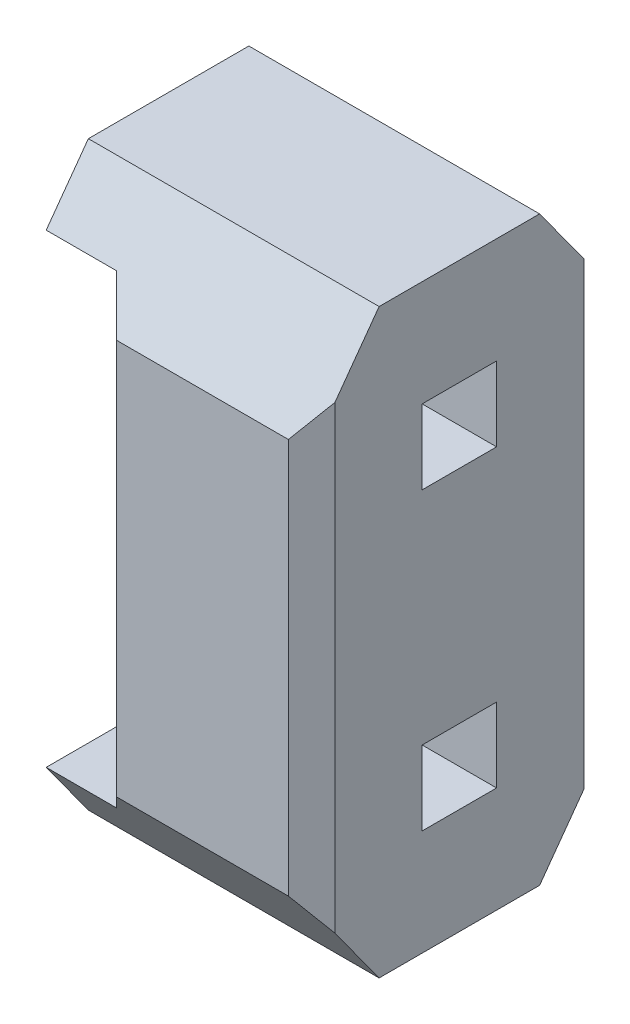
ISO-10303-21;
HEADER;
FILE_DESCRIPTION(('STEP AP214'),'2;1');
FILE_NAME('part.step','',(''),(''),'','','');
FILE_SCHEMA(('AUTOMOTIVE_DESIGN { 1 0 10303 214 1 1 1 1 }'));
ENDSEC;
DATA;
#1=APPLICATION_CONTEXT('core data for automotive mechanical design processes');
#2=APPLICATION_PROTOCOL_DEFINITION('international standard','automotive_design',2000,#1);
#3=PRODUCT_CONTEXT('',#1,'mechanical');
#4=PRODUCT('Part','Part','',(#3));
#5=PRODUCT_RELATED_PRODUCT_CATEGORY('part','',(#4));
#6=PRODUCT_DEFINITION_FORMATION('','',#4);
#7=PRODUCT_DEFINITION_CONTEXT('part definition',#1,'design');
#8=PRODUCT_DEFINITION('design','',#6,#7);
#9=PRODUCT_DEFINITION_SHAPE('','',#8);
#10=(LENGTH_UNIT() NAMED_UNIT(*) SI_UNIT(.MILLI.,.METRE.));
#11=(NAMED_UNIT(*) PLANE_ANGLE_UNIT() SI_UNIT($,.RADIAN.));
#12=(NAMED_UNIT(*) SI_UNIT($,.STERADIAN.) SOLID_ANGLE_UNIT());
#13=UNCERTAINTY_MEASURE_WITH_UNIT(LENGTH_MEASURE(1.E-05),#10,'distance_accuracy_value','');
#14=(GEOMETRIC_REPRESENTATION_CONTEXT(3) GLOBAL_UNCERTAINTY_ASSIGNED_CONTEXT((#13)) GLOBAL_UNIT_ASSIGNED_CONTEXT((#10,
#11,#12)) REPRESENTATION_CONTEXT('',''));
#15=CARTESIAN_POINT('',(0.,0.,0.));
#16=DIRECTION('',(0.,0.,1.));
#17=DIRECTION('',(1.,0.,0.));
#18=AXIS2_PLACEMENT_3D('',#15,#16,#17);
#19=CARTESIAN_POINT('',(1.25,4.6,-20.61));
#20=DIRECTION('',(0.,0.586967571460905,0.809610443394407));
#21=DIRECTION('',(0.,-0.809610443394407,0.586967571460905));
#22=AXIS2_PLACEMENT_3D('',#19,#20,#21);
#23=PLANE('',#22);
#24=DIRECTION('',(1.,0.,0.));
#25=VECTOR('',#24,1.);
#26=CARTESIAN_POINT('',(1.25,4.5,-20.5375));
#27=LINE('',#26,#25);
#28=CARTESIAN_POINT('',(0.,4.5,-20.5375));
#29=VERTEX_POINT('',#28);
#30=CARTESIAN_POINT('',(0.602500000000325,4.5,-20.5375000000001));
#31=VERTEX_POINT('',#30);
#32=EDGE_CURVE('E199',#29,#31,#27,.T.);
#33=ORIENTED_EDGE('',*,*,#32,.T.);
#34=DIRECTION('',(0.506207656348698,-0.698217457033983,0.506207656349602));
#35=VECTOR('',#34,1.);
#36=CARTESIAN_POINT('',(0.6025000000002,4.5,-20.5375));
#37=LINE('',#36,#35);
#38=CARTESIAN_POINT('',(0.819999999999671,4.2,-20.3199999999999));
#39=VERTEX_POINT('',#38);
#40=EDGE_CURVE('E197',#31,#39,#37,.T.);
#41=ORIENTED_EDGE('',*,*,#40,.T.);
#42=DIRECTION('',(1.,0.,0.));
#43=VECTOR('',#42,1.);
#44=CARTESIAN_POINT('',(1.25,4.19999999999999,-20.32));
#45=LINE('',#44,#43);
#46=CARTESIAN_POINT('',(2.30000000000012,4.2,-20.3199999999999));
#47=VERTEX_POINT('',#46);
#48=EDGE_CURVE('E20',#39,#47,#45,.T.);
#49=ORIENTED_EDGE('',*,*,#48,.T.);
#50=DIRECTION('',(0.506207656348961,0.698217457033859,-0.50620765634951));
#51=VECTOR('',#50,1.);
#52=CARTESIAN_POINT('',(2.3,4.19999999999999,-20.32));
#53=LINE('',#52,#51);
#54=CARTESIAN_POINT('',(2.49999999999988,4.47586206896591,-20.5200000000002));
#55=VERTEX_POINT('',#54);
#56=EDGE_CURVE('E181',#47,#55,#53,.T.);
#57=ORIENTED_EDGE('',*,*,#56,.T.);
#58=DIRECTION('',(0.,-0.809610443394407,0.586967571460905));
#59=VECTOR('',#58,1.);
#60=CARTESIAN_POINT('',(2.5,4.6,-20.61));
#61=LINE('',#60,#59);
#62=CARTESIAN_POINT('',(2.5,5.,-20.9));
#63=VERTEX_POINT('',#62);
#64=EDGE_CURVE('E188',#55,#63,#61,.F.);
#65=ORIENTED_EDGE('',*,*,#64,.T.);
#66=DIRECTION('',(1.,0.,0.));
#67=VECTOR('',#66,1.);
#68=CARTESIAN_POINT('',(1.25,5.,-20.9));
#69=LINE('',#68,#67);
#70=CARTESIAN_POINT('',(0.,5.,-20.9));
#71=VERTEX_POINT('',#70);
#72=EDGE_CURVE('E215',#71,#63,#69,.T.);
#73=ORIENTED_EDGE('',*,*,#72,.F.);
#74=DIRECTION('',(0.,-0.809610443394407,0.586967571460905));
#75=VECTOR('',#74,1.);
#76=CARTESIAN_POINT('',(0.,4.6,-20.61));
#77=LINE('',#76,#75);
#78=EDGE_CURVE('E207',#71,#29,#77,.T.);
#79=ORIENTED_EDGE('',*,*,#78,.T.);
#80=EDGE_LOOP('',(#33,#41,#49,#57,#65,#73,#79));
#81=FACE_BOUND('',#80,.T.);
#82=ADVANCED_FACE('F17',(#81),#23,.T.);
#83=CARTESIAN_POINT('',(1.25,4.6,-22.57));
#84=DIRECTION('',(0.,-0.586967571460905,0.809610443394407));
#85=DIRECTION('',(0.,-0.809610443394407,-0.586967571460905));
#86=AXIS2_PLACEMENT_3D('',#83,#84,#85);
#87=PLANE('',#86);
#88=DIRECTION('',(0.,-0.809610443394407,-0.586967571460905));
#89=VECTOR('',#88,1.);
#90=CARTESIAN_POINT('',(0.,4.6,-22.57));
#91=LINE('',#90,#89);
#92=CARTESIAN_POINT('',(0.,5.,-22.28));
#93=VERTEX_POINT('',#92);
#94=CARTESIAN_POINT('',(0.,4.5,-22.6425));
#95=VERTEX_POINT('',#94);
#96=EDGE_CURVE('E263',#93,#95,#91,.T.);
#97=ORIENTED_EDGE('',*,*,#96,.F.);
#98=DIRECTION('',(1.,0.,0.));
#99=VECTOR('',#98,1.);
#100=CARTESIAN_POINT('',(1.25,5.,-22.28));
#101=LINE('',#100,#99);
#102=CARTESIAN_POINT('',(2.5,5.,-22.28));
#103=VERTEX_POINT('',#102);
#104=EDGE_CURVE('E227',#103,#93,#101,.F.);
#105=ORIENTED_EDGE('',*,*,#104,.F.);
#106=DIRECTION('',(0.,-0.809610443394407,-0.586967571460905));
#107=VECTOR('',#106,1.);
#108=CARTESIAN_POINT('',(2.5,4.6,-22.57));
#109=LINE('',#108,#107);
#110=CARTESIAN_POINT('',(2.49999999999988,4.47586206896591,-22.6599999999998));
#111=VERTEX_POINT('',#110);
#112=EDGE_CURVE('E223',#111,#103,#109,.F.);
#113=ORIENTED_EDGE('',*,*,#112,.F.);
#114=DIRECTION('',(0.506207656348961,0.698217457033859,0.50620765634951));
#115=VECTOR('',#114,1.);
#116=CARTESIAN_POINT('',(2.3,4.19999999999999,-22.86));
#117=LINE('',#116,#115);
#118=CARTESIAN_POINT('',(2.30000000000012,4.2,-22.8600000000001));
#119=VERTEX_POINT('',#118);
#120=EDGE_CURVE('E266',#119,#111,#117,.T.);
#121=ORIENTED_EDGE('',*,*,#120,.F.);
#122=DIRECTION('',(1.,0.,0.));
#123=VECTOR('',#122,1.);
#124=CARTESIAN_POINT('',(1.25,4.19999999999999,-22.86));
#125=LINE('',#124,#123);
#126=CARTESIAN_POINT('',(0.819999999999671,4.2,-22.8600000000001));
#127=VERTEX_POINT('',#126);
#128=EDGE_CURVE('E205',#127,#119,#125,.T.);
#129=ORIENTED_EDGE('',*,*,#128,.F.);
#130=DIRECTION('',(0.506207656348698,-0.698217457033983,-0.506207656349602));
#131=VECTOR('',#130,1.);
#132=CARTESIAN_POINT('',(0.6025000000002,4.5,-22.6425));
#133=LINE('',#132,#131);
#134=CARTESIAN_POINT('',(0.602500000000325,4.5,-22.6424999999999));
#135=VERTEX_POINT('',#134);
#136=EDGE_CURVE('E203',#135,#127,#133,.T.);
#137=ORIENTED_EDGE('',*,*,#136,.F.);
#138=DIRECTION('',(1.,0.,0.));
#139=VECTOR('',#138,1.);
#140=CARTESIAN_POINT('',(1.25,4.5,-22.6425));
#141=LINE('',#140,#139);
#142=EDGE_CURVE('E261',#95,#135,#141,.T.);
#143=ORIENTED_EDGE('',*,*,#142,.F.);
#144=EDGE_LOOP('',(#97,#105,#113,#121,#129,#137,#143));
#145=FACE_BOUND('',#144,.T.);
#146=ADVANCED_FACE('F285',(#145),#87,.F.);
#147=CARTESIAN_POINT('',(1.25,0.4,-22.57));
#148=DIRECTION('',(0.,0.586967571460905,0.809610443394407));
#149=DIRECTION('',(0.,-0.809610443394407,0.586967571460905));
#150=AXIS2_PLACEMENT_3D('',#147,#148,#149);
#151=PLANE('',#150);
#152=DIRECTION('',(-0.506207656349401,0.698217457033646,-0.506207656349363));
#153=VECTOR('',#152,1.);
#154=CARTESIAN_POINT('',(2.5,0.524137931034496,-22.66));
#155=LINE('',#154,#153);
#156=CARTESIAN_POINT('',(2.49999999999988,0.524137931034498,-22.6599999999999));
#157=VERTEX_POINT('',#156);
#158=CARTESIAN_POINT('',(2.30000000000012,0.800000000000005,-22.8600000000001));
#159=VERTEX_POINT('',#158);
#160=EDGE_CURVE('E251',#157,#159,#155,.T.);
#161=ORIENTED_EDGE('',*,*,#160,.F.);
#162=DIRECTION('',(0.,-0.809610443394407,0.586967571460905));
#163=VECTOR('',#162,1.);
#164=CARTESIAN_POINT('',(2.5,0.4,-22.57));
#165=LINE('',#164,#163);
#166=CARTESIAN_POINT('',(2.5,0.,-22.28));
#167=VERTEX_POINT('',#166);
#168=EDGE_CURVE('E253',#167,#157,#165,.F.);
#169=ORIENTED_EDGE('',*,*,#168,.F.);
#170=DIRECTION('',(1.,0.,0.));
#171=VECTOR('',#170,1.);
#172=CARTESIAN_POINT('',(1.25,0.,-22.28));
#173=LINE('',#172,#171);
#174=CARTESIAN_POINT('',(0.,0.,-22.28));
#175=VERTEX_POINT('',#174);
#176=EDGE_CURVE('E288',#167,#175,#173,.F.);
#177=ORIENTED_EDGE('',*,*,#176,.T.);
#178=DIRECTION('',(0.,-0.809610443394407,0.586967571460905));
#179=VECTOR('',#178,1.);
#180=CARTESIAN_POINT('',(0.,0.4,-22.57));
#181=LINE('',#180,#179);
#182=CARTESIAN_POINT('',(0.,0.500000000000001,-22.6425));
#183=VERTEX_POINT('',#182);
#184=EDGE_CURVE('E255',#183,#175,#181,.T.);
#185=ORIENTED_EDGE('',*,*,#184,.F.);
#186=DIRECTION('',(1.,0.,0.));
#187=VECTOR('',#186,1.);
#188=CARTESIAN_POINT('',(1.25,0.500000000000002,-22.6425));
#189=LINE('',#188,#187);
#190=CARTESIAN_POINT('',(0.602500000000325,0.500000000000001,-22.6424999999999));
#191=VERTEX_POINT('',#190);
#192=EDGE_CURVE('E257',#191,#183,#189,.F.);
#193=ORIENTED_EDGE('',*,*,#192,.F.);
#194=DIRECTION('',(-0.506207656348694,-0.698217457033983,0.506207656349606));
#195=VECTOR('',#194,1.);
#196=CARTESIAN_POINT('',(0.8199999999998,0.80000000000001,-22.86));
#197=LINE('',#196,#195);
#198=CARTESIAN_POINT('',(0.819999999999671,0.800000000000005,-22.8600000000001));
#199=VERTEX_POINT('',#198);
#200=EDGE_CURVE('E259',#199,#191,#197,.T.);
#201=ORIENTED_EDGE('',*,*,#200,.F.);
#202=DIRECTION('',(1.,0.,0.));
#203=VECTOR('',#202,1.);
#204=CARTESIAN_POINT('',(1.25,0.80000000000001,-22.86));
#205=LINE('',#204,#203);
#206=EDGE_CURVE('E249',#159,#199,#205,.F.);
#207=ORIENTED_EDGE('',*,*,#206,.F.);
#208=EDGE_LOOP('',(#161,#169,#177,#185,#193,#201,#207));
#209=FACE_BOUND('',#208,.T.);
#210=ADVANCED_FACE('F431',(#209),#151,.F.);
#211=CARTESIAN_POINT('',(1.25,0.4,-20.61));
#212=DIRECTION('',(0.,-0.586967571460905,0.809610443394407));
#213=DIRECTION('',(0.,-0.809610443394407,-0.586967571460905));
#214=AXIS2_PLACEMENT_3D('',#211,#212,#213);
#215=PLANE('',#214);
#216=DIRECTION('',(1.,0.,0.));
#217=VECTOR('',#216,1.);
#218=CARTESIAN_POINT('',(1.25,0.80000000000001,-20.32));
#219=LINE('',#218,#217);
#220=CARTESIAN_POINT('',(2.30000000000012,0.800000000000005,-20.3199999999999));
#221=VERTEX_POINT('',#220);
#222=CARTESIAN_POINT('',(0.819999999999671,0.800000000000005,-20.3199999999999));
#223=VERTEX_POINT('',#222);
#224=EDGE_CURVE('E191',#221,#223,#219,.F.);
#225=ORIENTED_EDGE('',*,*,#224,.T.);
#226=DIRECTION('',(-0.506207656348694,-0.698217457033983,-0.506207656349606));
#227=VECTOR('',#226,1.);
#228=CARTESIAN_POINT('',(0.8199999999998,0.80000000000001,-20.32));
#229=LINE('',#228,#227);
#230=CARTESIAN_POINT('',(0.602500000000325,0.500000000000001,-20.5375000000001));
#231=VERTEX_POINT('',#230);
#232=EDGE_CURVE('E232',#223,#231,#229,.T.);
#233=ORIENTED_EDGE('',*,*,#232,.T.);
#234=DIRECTION('',(1.,0.,0.));
#235=VECTOR('',#234,1.);
#236=CARTESIAN_POINT('',(1.25,0.500000000000002,-20.5375));
#237=LINE('',#236,#235);
#238=CARTESIAN_POINT('',(0.,0.500000000000001,-20.5375));
#239=VERTEX_POINT('',#238);
#240=EDGE_CURVE('E246',#231,#239,#237,.F.);
#241=ORIENTED_EDGE('',*,*,#240,.T.);
#242=DIRECTION('',(0.,-0.809610443394407,-0.586967571460905));
#243=VECTOR('',#242,1.);
#244=CARTESIAN_POINT('',(0.,0.4,-20.61));
#245=LINE('',#244,#243);
#246=CARTESIAN_POINT('',(0.,0.,-20.9));
#247=VERTEX_POINT('',#246);
#248=EDGE_CURVE('E244',#239,#247,#245,.T.);
#249=ORIENTED_EDGE('',*,*,#248,.T.);
#250=DIRECTION('',(1.,0.,0.));
#251=VECTOR('',#250,1.);
#252=CARTESIAN_POINT('',(1.25,0.,-20.9));
#253=LINE('',#252,#251);
#254=CARTESIAN_POINT('',(2.5,0.,-20.9));
#255=VERTEX_POINT('',#254);
#256=EDGE_CURVE('E293',#247,#255,#253,.T.);
#257=ORIENTED_EDGE('',*,*,#256,.T.);
#258=DIRECTION('',(0.,-0.809610443394407,-0.586967571460905));
#259=VECTOR('',#258,1.);
#260=CARTESIAN_POINT('',(2.5,0.4,-20.61));
#261=LINE('',#260,#259);
#262=CARTESIAN_POINT('',(2.49999999999988,0.524137931034498,-20.5200000000001));
#263=VERTEX_POINT('',#262);
#264=EDGE_CURVE('E241',#255,#263,#261,.F.);
#265=ORIENTED_EDGE('',*,*,#264,.T.);
#266=DIRECTION('',(-0.506207656349401,0.698217457033646,0.506207656349363));
#267=VECTOR('',#266,1.);
#268=CARTESIAN_POINT('',(2.5,0.524137931034496,-20.52));
#269=LINE('',#268,#267);
#270=EDGE_CURVE('E239',#263,#221,#269,.T.);
#271=ORIENTED_EDGE('',*,*,#270,.T.);
#272=EDGE_LOOP('',(#225,#233,#241,#249,#257,#265,#271));
#273=FACE_BOUND('',#272,.T.);
#274=ADVANCED_FACE('F421',(#273),#215,.T.);
#275=CARTESIAN_POINT('',(1.25,5.,-21.59));
#276=DIRECTION('',(0.,1.,0.));
#277=DIRECTION('',(0.,0.,1.));
#278=AXIS2_PLACEMENT_3D('',#275,#276,#277);
#279=PLANE('',#278);
#280=ORIENTED_EDGE('',*,*,#104,.T.);
#281=DIRECTION('',(0.,0.,-1.));
#282=VECTOR('',#281,1.);
#283=CARTESIAN_POINT('',(0.,5.,-21.59));
#284=LINE('',#283,#282);
#285=EDGE_CURVE('E231',#93,#71,#284,.F.);
#286=ORIENTED_EDGE('',*,*,#285,.T.);
#287=ORIENTED_EDGE('',*,*,#72,.T.);
#288=DIRECTION('',(0.,0.,1.));
#289=VECTOR('',#288,1.);
#290=CARTESIAN_POINT('',(2.5,5.,-21.59));
#291=LINE('',#290,#289);
#292=EDGE_CURVE('E219',#63,#103,#291,.F.);
#293=ORIENTED_EDGE('',*,*,#292,.T.);
#294=EDGE_LOOP('',(#280,#286,#287,#293));
#295=FACE_BOUND('',#294,.T.);
#296=ADVANCED_FACE('F229',(#295),#279,.T.);
#297=CARTESIAN_POINT('',(1.25,0.,-21.59));
#298=DIRECTION('',(0.,1.,0.));
#299=DIRECTION('',(0.,0.,1.));
#300=AXIS2_PLACEMENT_3D('',#297,#298,#299);
#301=PLANE('',#300);
#302=DIRECTION('',(0.,0.,-1.));
#303=VECTOR('',#302,1.);
#304=CARTESIAN_POINT('',(0.,0.,-21.59));
#305=LINE('',#304,#303);
#306=EDGE_CURVE('E297',#247,#175,#305,.T.);
#307=ORIENTED_EDGE('',*,*,#306,.T.);
#308=ORIENTED_EDGE('',*,*,#176,.F.);
#309=DIRECTION('',(0.,0.,1.));
#310=VECTOR('',#309,1.);
#311=CARTESIAN_POINT('',(2.5,0.,-21.59));
#312=LINE('',#311,#310);
#313=EDGE_CURVE('E287',#255,#167,#312,.F.);
#314=ORIENTED_EDGE('',*,*,#313,.F.);
#315=ORIENTED_EDGE('',*,*,#256,.F.);
#316=EDGE_LOOP('',(#307,#308,#314,#315));
#317=FACE_BOUND('',#316,.T.);
#318=ADVANCED_FACE('F428',(#317),#301,.F.);
#319=CARTESIAN_POINT('',(0.,4.75,-21.59));
#320=DIRECTION('',(1.,0.,0.));
#321=DIRECTION('',(0.,0.,-1.));
#322=AXIS2_PLACEMENT_3D('',#319,#320,#321);
#323=PLANE('',#322);
#324=ORIENTED_EDGE('',*,*,#285,.F.);
#325=ORIENTED_EDGE('',*,*,#96,.T.);
#326=DIRECTION('',(0.,0.,1.));
#327=VECTOR('',#326,1.);
#328=CARTESIAN_POINT('',(0.,4.5,-21.59));
#329=LINE('',#328,#327);
#330=EDGE_CURVE('E307',#95,#29,#329,.T.);
#331=ORIENTED_EDGE('',*,*,#330,.T.);
#332=ORIENTED_EDGE('',*,*,#78,.F.);
#333=EDGE_LOOP('',(#324,#325,#331,#332));
#334=FACE_BOUND('',#333,.T.);
#335=ADVANCED_FACE('F441',(#334),#323,.F.);
#336=CARTESIAN_POINT('',(0.,0.25,-21.59));
#337=DIRECTION('',(1.,0.,0.));
#338=DIRECTION('',(0.,0.,-1.));
#339=AXIS2_PLACEMENT_3D('',#336,#337,#338);
#340=PLANE('',#339);
#341=ORIENTED_EDGE('',*,*,#306,.F.);
#342=ORIENTED_EDGE('',*,*,#248,.F.);
#343=DIRECTION('',(0.,0.,1.));
#344=VECTOR('',#343,1.);
#345=CARTESIAN_POINT('',(0.,0.5,-21.59));
#346=LINE('',#345,#344);
#347=EDGE_CURVE('E315',#183,#239,#346,.T.);
#348=ORIENTED_EDGE('',*,*,#347,.F.);
#349=ORIENTED_EDGE('',*,*,#184,.T.);
#350=EDGE_LOOP('',(#341,#342,#348,#349));
#351=FACE_BOUND('',#350,.T.);
#352=ADVANCED_FACE('F443',(#351),#340,.F.);
#353=CARTESIAN_POINT('',(1.55,3.45,-21.59));
#354=DIRECTION('',(0.,1.,0.));
#355=DIRECTION('',(0.,0.,1.));
#356=AXIS2_PLACEMENT_3D('',#353,#354,#355);
#357=PLANE('',#356);
#358=DIRECTION('',(1.,0.,0.));
#359=VECTOR('',#358,1.);
#360=CARTESIAN_POINT('',(1.55,3.45,-21.91));
#361=LINE('',#360,#359);
#362=CARTESIAN_POINT('',(0.6,3.45,-21.91));
#363=VERTEX_POINT('',#362);
#364=CARTESIAN_POINT('',(2.5,3.45,-21.91));
#365=VERTEX_POINT('',#364);
#366=EDGE_CURVE('E332',#363,#365,#361,.T.);
#367=ORIENTED_EDGE('',*,*,#366,.F.);
#368=DIRECTION('',(0.,0.,1.));
#369=VECTOR('',#368,1.);
#370=CARTESIAN_POINT('',(0.6,3.45,-21.59));
#371=LINE('',#370,#369);
#372=CARTESIAN_POINT('',(0.6,3.45,-21.27));
#373=VERTEX_POINT('',#372);
#374=EDGE_CURVE('E302',#363,#373,#371,.T.);
#375=ORIENTED_EDGE('',*,*,#374,.T.);
#376=DIRECTION('',(1.,0.,0.));
#377=VECTOR('',#376,1.);
#378=CARTESIAN_POINT('',(1.55,3.45,-21.27));
#379=LINE('',#378,#377);
#380=CARTESIAN_POINT('',(2.5,3.45,-21.27));
#381=VERTEX_POINT('',#380);
#382=EDGE_CURVE('E327',#373,#381,#379,.T.);
#383=ORIENTED_EDGE('',*,*,#382,.T.);
#384=DIRECTION('',(0.,0.,1.));
#385=VECTOR('',#384,1.);
#386=CARTESIAN_POINT('',(2.5,3.45,-21.59));
#387=LINE('',#386,#385);
#388=EDGE_CURVE('E300',#381,#365,#387,.F.);
#389=ORIENTED_EDGE('',*,*,#388,.T.);
#390=EDGE_LOOP('',(#367,#375,#383,#389));
#391=FACE_BOUND('',#390,.T.);
#392=ADVANCED_FACE('F398',(#391),#357,.T.);
#393=CARTESIAN_POINT('',(0.71,2.5,-22.75));
#394=DIRECTION('',(0.707106781190498,0.,0.707106781182598));
#395=DIRECTION('',(0.707106781182598,0.,-0.707106781190498));
#396=AXIS2_PLACEMENT_3D('',#393,#394,#395);
#397=PLANE('',#396);
#398=ORIENTED_EDGE('',*,*,#200,.T.);
#399=DIRECTION('',(0.70710678118667,0.,-0.707106781186425));
#400=VECTOR('',#399,1.);
#401=CARTESIAN_POINT('',(0.6000000000002,0.5,-22.64));
#402=LINE('',#401,#400);
#403=CARTESIAN_POINT('',(0.600000000000408,0.5,-22.6399999999997));
#404=VERTEX_POINT('',#403);
#405=EDGE_CURVE('E312',#404,#191,#402,.T.);
#406=ORIENTED_EDGE('',*,*,#405,.F.);
#407=DIRECTION('',(0.,1.,0.));
#408=VECTOR('',#407,1.);
#409=CARTESIAN_POINT('',(0.6,2.5,-22.64));
#410=LINE('',#409,#408);
#411=CARTESIAN_POINT('',(0.600000000000408,4.5,-22.6399999999997));
#412=VERTEX_POINT('',#411);
#413=EDGE_CURVE('E337',#404,#412,#410,.T.);
#414=ORIENTED_EDGE('',*,*,#413,.T.);
#415=DIRECTION('',(0.70710678118667,0.,-0.707106781186425));
#416=VECTOR('',#415,1.);
#417=CARTESIAN_POINT('',(0.6000000000002,4.5,-22.64));
#418=LINE('',#417,#416);
#419=EDGE_CURVE('E304',#412,#135,#418,.T.);
#420=ORIENTED_EDGE('',*,*,#419,.T.);
#421=ORIENTED_EDGE('',*,*,#136,.T.);
#422=DIRECTION('',(0.,1.,0.));
#423=VECTOR('',#422,1.);
#424=CARTESIAN_POINT('',(0.8199999999998,2.5,-22.86));
#425=LINE('',#424,#423);
#426=EDGE_CURVE('E275',#127,#199,#425,.F.);
#427=ORIENTED_EDGE('',*,*,#426,.T.);
#428=EDGE_LOOP('',(#398,#406,#414,#420,#421,#427));
#429=FACE_BOUND('',#428,.T.);
#430=ADVANCED_FACE('F435',(#429),#397,.F.);
#431=CARTESIAN_POINT('',(0.30125,4.5,-21.59));
#432=DIRECTION('',(0.,1.,0.));
#433=DIRECTION('',(0.,0.,1.));
#434=AXIS2_PLACEMENT_3D('',#431,#432,#433);
#435=PLANE('',#434);
#436=ORIENTED_EDGE('',*,*,#142,.T.);
#437=ORIENTED_EDGE('',*,*,#419,.F.);
#438=DIRECTION('',(0.,0.,-1.));
#439=VECTOR('',#438,1.);
#440=CARTESIAN_POINT('',(0.6,4.5,-21.59));
#441=LINE('',#440,#439);
#442=CARTESIAN_POINT('',(0.600000000000279,4.5,-20.5400000000001));
#443=VERTEX_POINT('',#442);
#444=EDGE_CURVE('E339',#412,#443,#441,.F.);
#445=ORIENTED_EDGE('',*,*,#444,.T.);
#446=DIRECTION('',(-0.707106781182598,0.,-0.707106781190498));
#447=VECTOR('',#446,1.);
#448=CARTESIAN_POINT('',(0.71,4.5,-20.43));
#449=LINE('',#448,#447);
#450=EDGE_CURVE('E310',#443,#31,#449,.F.);
#451=ORIENTED_EDGE('',*,*,#450,.T.);
#452=ORIENTED_EDGE('',*,*,#32,.F.);
#453=ORIENTED_EDGE('',*,*,#330,.F.);
#454=EDGE_LOOP('',(#436,#437,#445,#451,#452,#453));
#455=FACE_BOUND('',#454,.T.);
#456=ADVANCED_FACE('F439',(#455),#435,.F.);
#457=CARTESIAN_POINT('',(0.71,2.5,-20.43));
#458=DIRECTION('',(0.707106781190498,0.,-0.707106781182598));
#459=DIRECTION('',(-0.707106781182598,0.,-0.707106781190498));
#460=AXIS2_PLACEMENT_3D('',#457,#458,#459);
#461=PLANE('',#460);
#462=ORIENTED_EDGE('',*,*,#232,.F.);
#463=DIRECTION('',(0.,1.,0.));
#464=VECTOR('',#463,1.);
#465=CARTESIAN_POINT('',(0.8199999999998,2.5,-20.32));
#466=LINE('',#465,#464);
#467=EDGE_CURVE('E325',#39,#223,#466,.F.);
#468=ORIENTED_EDGE('',*,*,#467,.F.);
#469=ORIENTED_EDGE('',*,*,#40,.F.);
#470=ORIENTED_EDGE('',*,*,#450,.F.);
#471=DIRECTION('',(0.,1.,0.));
#472=VECTOR('',#471,1.);
#473=CARTESIAN_POINT('',(0.6,2.5,-20.54));
#474=LINE('',#473,#472);
#475=CARTESIAN_POINT('',(0.600000000000408,0.5,-20.5400000000003));
#476=VERTEX_POINT('',#475);
#477=EDGE_CURVE('E341',#443,#476,#474,.F.);
#478=ORIENTED_EDGE('',*,*,#477,.T.);
#479=DIRECTION('',(-0.70710678118667,0.,-0.707106781186425));
#480=VECTOR('',#479,1.);
#481=CARTESIAN_POINT('',(0.6025000000002,0.5,-20.5375));
#482=LINE('',#481,#480);
#483=EDGE_CURVE('E318',#231,#476,#482,.T.);
#484=ORIENTED_EDGE('',*,*,#483,.F.);
#485=EDGE_LOOP('',(#462,#468,#469,#470,#478,#484));
#486=FACE_BOUND('',#485,.T.);
#487=ADVANCED_FACE('F416',(#486),#461,.F.);
#488=CARTESIAN_POINT('',(0.30125,0.5,-21.59));
#489=DIRECTION('',(0.,1.,0.));
#490=DIRECTION('',(0.,0.,1.));
#491=AXIS2_PLACEMENT_3D('',#488,#489,#490);
#492=PLANE('',#491);
#493=ORIENTED_EDGE('',*,*,#483,.T.);
#494=DIRECTION('',(0.,0.,-1.));
#495=VECTOR('',#494,1.);
#496=CARTESIAN_POINT('',(0.6,0.5,-21.59));
#497=LINE('',#496,#495);
#498=EDGE_CURVE('E343',#476,#404,#497,.T.);
#499=ORIENTED_EDGE('',*,*,#498,.T.);
#500=ORIENTED_EDGE('',*,*,#405,.T.);
#501=ORIENTED_EDGE('',*,*,#192,.T.);
#502=ORIENTED_EDGE('',*,*,#347,.T.);
#503=ORIENTED_EDGE('',*,*,#240,.F.);
#504=EDGE_LOOP('',(#493,#499,#500,#501,#502,#503));
#505=FACE_BOUND('',#504,.T.);
#506=ADVANCED_FACE('F418',(#505),#492,.T.);
#507=CARTESIAN_POINT('',(1.55,1.23,-21.91));
#508=DIRECTION('',(0.,0.,1.));
#509=DIRECTION('',(1.,0.,0.));
#510=AXIS2_PLACEMENT_3D('',#507,#508,#509);
#511=PLANE('',#510);
#512=DIRECTION('',(1.,0.,0.));
#513=VECTOR('',#512,1.);
#514=CARTESIAN_POINT('',(1.55,1.55,-21.91));
#515=LINE('',#514,#513);
#516=CARTESIAN_POINT('',(2.5,1.55,-21.91));
#517=VERTEX_POINT('',#516);
#518=CARTESIAN_POINT('',(0.6,1.55,-21.91));
#519=VERTEX_POINT('',#518);
#520=EDGE_CURVE('E283',#517,#519,#515,.F.);
#521=ORIENTED_EDGE('',*,*,#520,.T.);
#522=DIRECTION('',(0.,1.,0.));
#523=VECTOR('',#522,1.);
#524=CARTESIAN_POINT('',(0.6,2.5,-21.91));
#525=LINE('',#524,#523);
#526=CARTESIAN_POINT('',(0.6,0.91,-21.91));
#527=VERTEX_POINT('',#526);
#528=EDGE_CURVE('E346',#519,#527,#525,.F.);
#529=ORIENTED_EDGE('',*,*,#528,.T.);
#530=DIRECTION('',(1.,0.,0.));
#531=VECTOR('',#530,1.);
#532=CARTESIAN_POINT('',(1.55,0.91,-21.91));
#533=LINE('',#532,#531);
#534=CARTESIAN_POINT('',(2.5,0.91,-21.91));
#535=VERTEX_POINT('',#534);
#536=EDGE_CURVE('E354',#535,#527,#533,.F.);
#537=ORIENTED_EDGE('',*,*,#536,.F.);
#538=DIRECTION('',(0.,1.,0.));
#539=VECTOR('',#538,1.);
#540=CARTESIAN_POINT('',(2.5,1.23,-21.91));
#541=LINE('',#540,#539);
#542=EDGE_CURVE('E321',#535,#517,#541,.T.);
#543=ORIENTED_EDGE('',*,*,#542,.T.);
#544=EDGE_LOOP('',(#521,#529,#537,#543));
#545=FACE_BOUND('',#544,.T.);
#546=ADVANCED_FACE('F483',(#545),#511,.T.);
#547=CARTESIAN_POINT('',(1.56,2.5,-22.86));
#548=DIRECTION('',(0.,0.,1.));
#549=DIRECTION('',(1.,0.,0.));
#550=AXIS2_PLACEMENT_3D('',#547,#548,#549);
#551=PLANE('',#550);
#552=DIRECTION('',(0.,1.,0.));
#553=VECTOR('',#552,1.);
#554=CARTESIAN_POINT('',(2.30000000000048,2.5,-22.8600000000005));
#555=LINE('',#554,#553);
#556=EDGE_CURVE('E193',#159,#119,#555,.T.);
#557=ORIENTED_EDGE('',*,*,#556,.F.);
#558=ORIENTED_EDGE('',*,*,#206,.T.);
#559=ORIENTED_EDGE('',*,*,#426,.F.);
#560=ORIENTED_EDGE('',*,*,#128,.T.);
#561=EDGE_LOOP('',(#557,#558,#559,#560));
#562=FACE_BOUND('',#561,.T.);
#563=ADVANCED_FACE('F272',(#562),#551,.F.);
#564=CARTESIAN_POINT('',(1.56,2.5,-20.32));
#565=DIRECTION('',(0.,0.,1.));
#566=DIRECTION('',(1.,0.,0.));
#567=AXIS2_PLACEMENT_3D('',#564,#565,#566);
#568=PLANE('',#567);
#569=ORIENTED_EDGE('',*,*,#48,.F.);
#570=ORIENTED_EDGE('',*,*,#467,.T.);
#571=ORIENTED_EDGE('',*,*,#224,.F.);
#572=DIRECTION('',(0.,1.,0.));
#573=VECTOR('',#572,1.);
#574=CARTESIAN_POINT('',(2.30000000000047,2.5,-20.3199999999995));
#575=LINE('',#574,#573);
#576=EDGE_CURVE('E183',#47,#221,#575,.F.);
#577=ORIENTED_EDGE('',*,*,#576,.F.);
#578=EDGE_LOOP('',(#569,#570,#571,#577));
#579=FACE_BOUND('',#578,.T.);
#580=ADVANCED_FACE('F189',(#579),#568,.T.);
#581=CARTESIAN_POINT('',(1.55,3.77,-21.27));
#582=DIRECTION('',(0.,0.,1.));
#583=DIRECTION('',(1.,0.,0.));
#584=AXIS2_PLACEMENT_3D('',#581,#582,#583);
#585=PLANE('',#584);
#586=DIRECTION('',(0.,1.,0.));
#587=VECTOR('',#586,1.);
#588=CARTESIAN_POINT('',(2.5,3.77,-21.27));
#589=LINE('',#588,#587);
#590=CARTESIAN_POINT('',(2.5,4.09,-21.27));
#591=VERTEX_POINT('',#590);
#592=EDGE_CURVE('E330',#381,#591,#589,.T.);
#593=ORIENTED_EDGE('',*,*,#592,.F.);
#594=ORIENTED_EDGE('',*,*,#382,.F.);
#595=DIRECTION('',(0.,1.,0.));
#596=VECTOR('',#595,1.);
#597=CARTESIAN_POINT('',(0.6,2.5,-21.27));
#598=LINE('',#597,#596);
#599=CARTESIAN_POINT('',(0.6,4.09,-21.27));
#600=VERTEX_POINT('',#599);
#601=EDGE_CURVE('E351',#373,#600,#598,.T.);
#602=ORIENTED_EDGE('',*,*,#601,.T.);
#603=DIRECTION('',(1.,0.,0.));
#604=VECTOR('',#603,1.);
#605=CARTESIAN_POINT('',(1.55,4.09,-21.27));
#606=LINE('',#605,#604);
#607=EDGE_CURVE('E368',#600,#591,#606,.T.);
#608=ORIENTED_EDGE('',*,*,#607,.T.);
#609=EDGE_LOOP('',(#593,#594,#602,#608));
#610=FACE_BOUND('',#609,.T.);
#611=ADVANCED_FACE('F402',(#610),#585,.F.);
#612=CARTESIAN_POINT('',(1.55,3.77,-21.91));
#613=DIRECTION('',(0.,0.,1.));
#614=DIRECTION('',(1.,0.,0.));
#615=AXIS2_PLACEMENT_3D('',#612,#613,#614);
#616=PLANE('',#615);
#617=DIRECTION('',(1.,0.,0.));
#618=VECTOR('',#617,1.);
#619=CARTESIAN_POINT('',(1.55,4.09,-21.91));
#620=LINE('',#619,#618);
#621=CARTESIAN_POINT('',(2.5,4.09,-21.91));
#622=VERTEX_POINT('',#621);
#623=CARTESIAN_POINT('',(0.6,4.09,-21.91));
#624=VERTEX_POINT('',#623);
#625=EDGE_CURVE('E371',#622,#624,#620,.F.);
#626=ORIENTED_EDGE('',*,*,#625,.T.);
#627=DIRECTION('',(0.,1.,0.));
#628=VECTOR('',#627,1.);
#629=CARTESIAN_POINT('',(0.6,2.5,-21.91));
#630=LINE('',#629,#628);
#631=EDGE_CURVE('E348',#624,#363,#630,.F.);
#632=ORIENTED_EDGE('',*,*,#631,.T.);
#633=ORIENTED_EDGE('',*,*,#366,.T.);
#634=DIRECTION('',(0.,1.,0.));
#635=VECTOR('',#634,1.);
#636=CARTESIAN_POINT('',(2.5,3.77,-21.91));
#637=LINE('',#636,#635);
#638=EDGE_CURVE('E335',#365,#622,#637,.T.);
#639=ORIENTED_EDGE('',*,*,#638,.T.);
#640=EDGE_LOOP('',(#626,#632,#633,#639));
#641=FACE_BOUND('',#640,.T.);
#642=ADVANCED_FACE('F395',(#641),#616,.T.);
#643=CARTESIAN_POINT('',(0.6,2.5,-21.59));
#644=DIRECTION('',(1.,0.,0.));
#645=DIRECTION('',(0.,0.,-1.));
#646=AXIS2_PLACEMENT_3D('',#643,#644,#645);
#647=PLANE('',#646);
#648=ORIENTED_EDGE('',*,*,#374,.F.);
#649=ORIENTED_EDGE('',*,*,#631,.F.);
#650=DIRECTION('',(0.,0.,1.));
#651=VECTOR('',#650,1.);
#652=CARTESIAN_POINT('',(0.6,4.09,-21.59));
#653=LINE('',#652,#651);
#654=EDGE_CURVE('E192',#624,#600,#653,.T.);
#655=ORIENTED_EDGE('',*,*,#654,.T.);
#656=ORIENTED_EDGE('',*,*,#601,.F.);
#657=EDGE_LOOP('',(#648,#649,#655,#656));
#658=FACE_BOUND('',#657,.T.);
#659=ORIENTED_EDGE('',*,*,#528,.F.);
#660=DIRECTION('',(0.,0.,1.));
#661=VECTOR('',#660,1.);
#662=CARTESIAN_POINT('',(0.6,1.55,-21.59));
#663=LINE('',#662,#661);
#664=CARTESIAN_POINT('',(0.6,1.55,-21.27));
#665=VERTEX_POINT('',#664);
#666=EDGE_CURVE('E360',#519,#665,#663,.T.);
#667=ORIENTED_EDGE('',*,*,#666,.T.);
#668=DIRECTION('',(0.,1.,0.));
#669=VECTOR('',#668,1.);
#670=CARTESIAN_POINT('',(0.6,1.23,-21.27));
#671=LINE('',#670,#669);
#672=CARTESIAN_POINT('',(0.6,0.91,-21.27));
#673=VERTEX_POINT('',#672);
#674=EDGE_CURVE('E374',#665,#673,#671,.F.);
#675=ORIENTED_EDGE('',*,*,#674,.T.);
#676=DIRECTION('',(0.,0.,1.));
#677=VECTOR('',#676,1.);
#678=CARTESIAN_POINT('',(0.6,0.91,-21.59));
#679=LINE('',#678,#677);
#680=EDGE_CURVE('E357',#527,#673,#679,.T.);
#681=ORIENTED_EDGE('',*,*,#680,.F.);
#682=EDGE_LOOP('',(#659,#667,#675,#681));
#683=FACE_BOUND('',#682,.T.);
#684=ORIENTED_EDGE('',*,*,#477,.F.);
#685=ORIENTED_EDGE('',*,*,#444,.F.);
#686=ORIENTED_EDGE('',*,*,#413,.F.);
#687=ORIENTED_EDGE('',*,*,#498,.F.);
#688=EDGE_LOOP('',(#684,#685,#686,#687));
#689=FACE_BOUND('',#688,.T.);
#690=ADVANCED_FACE('F404',(#658,#683,#689),#647,.F.);
#691=CARTESIAN_POINT('',(1.55,0.91,-21.59));
#692=DIRECTION('',(0.,1.,0.));
#693=DIRECTION('',(0.,0.,1.));
#694=AXIS2_PLACEMENT_3D('',#691,#692,#693);
#695=PLANE('',#694);
#696=ORIENTED_EDGE('',*,*,#536,.T.);
#697=ORIENTED_EDGE('',*,*,#680,.T.);
#698=DIRECTION('',(1.,0.,0.));
#699=VECTOR('',#698,1.);
#700=CARTESIAN_POINT('',(1.55,0.91,-21.27));
#701=LINE('',#700,#699);
#702=CARTESIAN_POINT('',(2.5,0.91,-21.27));
#703=VERTEX_POINT('',#702);
#704=EDGE_CURVE('E376',#673,#703,#701,.T.);
#705=ORIENTED_EDGE('',*,*,#704,.T.);
#706=DIRECTION('',(0.,0.,1.));
#707=VECTOR('',#706,1.);
#708=CARTESIAN_POINT('',(2.5,0.91,-21.59));
#709=LINE('',#708,#707);
#710=EDGE_CURVE('E34',#703,#535,#709,.F.);
#711=ORIENTED_EDGE('',*,*,#710,.T.);
#712=EDGE_LOOP('',(#696,#697,#705,#711));
#713=FACE_BOUND('',#712,.T.);
#714=ADVANCED_FACE('F407',(#713),#695,.T.);
#715=CARTESIAN_POINT('',(1.55,1.55,-21.59));
#716=DIRECTION('',(0.,1.,0.));
#717=DIRECTION('',(0.,0.,1.));
#718=AXIS2_PLACEMENT_3D('',#715,#716,#717);
#719=PLANE('',#718);
#720=DIRECTION('',(0.,0.,1.));
#721=VECTOR('',#720,1.);
#722=CARTESIAN_POINT('',(2.5,1.55,-21.59));
#723=LINE('',#722,#721);
#724=CARTESIAN_POINT('',(2.5,1.55,-21.27));
#725=VERTEX_POINT('',#724);
#726=EDGE_CURVE('E362',#725,#517,#723,.F.);
#727=ORIENTED_EDGE('',*,*,#726,.F.);
#728=DIRECTION('',(1.,0.,0.));
#729=VECTOR('',#728,1.);
#730=CARTESIAN_POINT('',(1.55,1.55,-21.27));
#731=LINE('',#730,#729);
#732=EDGE_CURVE('E378',#725,#665,#731,.F.);
#733=ORIENTED_EDGE('',*,*,#732,.T.);
#734=ORIENTED_EDGE('',*,*,#666,.F.);
#735=ORIENTED_EDGE('',*,*,#520,.F.);
#736=EDGE_LOOP('',(#727,#733,#734,#735));
#737=FACE_BOUND('',#736,.T.);
#738=ADVANCED_FACE('F468',(#737),#719,.F.);
#739=CARTESIAN_POINT('',(2.4,2.5,-22.76));
#740=DIRECTION('',(0.707106781189898,0.,-0.707106781183198));
#741=DIRECTION('',(-0.707106781183198,0.,-0.707106781189898));
#742=AXIS2_PLACEMENT_3D('',#739,#740,#741);
#743=PLANE('',#742);
#744=DIRECTION('',(0.,1.,0.));
#745=VECTOR('',#744,1.);
#746=CARTESIAN_POINT('',(2.5,2.5,-22.66));
#747=LINE('',#746,#745);
#748=EDGE_CURVE('E381',#157,#111,#747,.T.);
#749=ORIENTED_EDGE('',*,*,#748,.F.);
#750=ORIENTED_EDGE('',*,*,#160,.T.);
#751=ORIENTED_EDGE('',*,*,#556,.T.);
#752=ORIENTED_EDGE('',*,*,#120,.T.);
#753=EDGE_LOOP('',(#749,#750,#751,#752));
#754=FACE_BOUND('',#753,.T.);
#755=ADVANCED_FACE('F281',(#754),#743,.T.);
#756=CARTESIAN_POINT('',(2.4,2.5,-20.42));
#757=DIRECTION('',(0.707106781189898,0.,0.707106781183198));
#758=DIRECTION('',(0.707106781183198,0.,-0.707106781189898));
#759=AXIS2_PLACEMENT_3D('',#756,#757,#758);
#760=PLANE('',#759);
#761=DIRECTION('',(0.,1.,0.));
#762=VECTOR('',#761,1.);
#763=CARTESIAN_POINT('',(2.5,2.5,-20.52));
#764=LINE('',#763,#762);
#765=EDGE_CURVE('E186',#55,#263,#764,.F.);
#766=ORIENTED_EDGE('',*,*,#765,.F.);
#767=ORIENTED_EDGE('',*,*,#56,.F.);
#768=ORIENTED_EDGE('',*,*,#576,.T.);
#769=ORIENTED_EDGE('',*,*,#270,.F.);
#770=EDGE_LOOP('',(#766,#767,#768,#769));
#771=FACE_BOUND('',#770,.T.);
#772=ADVANCED_FACE('F182',(#771),#760,.T.);
#773=CARTESIAN_POINT('',(1.55,4.09,-21.59));
#774=DIRECTION('',(0.,1.,0.));
#775=DIRECTION('',(0.,0.,1.));
#776=AXIS2_PLACEMENT_3D('',#773,#774,#775);
#777=PLANE('',#776);
#778=DIRECTION('',(0.,0.,-1.));
#779=VECTOR('',#778,1.);
#780=CARTESIAN_POINT('',(2.5,4.09,-21.59));
#781=LINE('',#780,#779);
#782=EDGE_CURVE('E26',#591,#622,#781,.T.);
#783=ORIENTED_EDGE('',*,*,#782,.F.);
#784=ORIENTED_EDGE('',*,*,#607,.F.);
#785=ORIENTED_EDGE('',*,*,#654,.F.);
#786=ORIENTED_EDGE('',*,*,#625,.F.);
#787=EDGE_LOOP('',(#783,#784,#785,#786));
#788=FACE_BOUND('',#787,.T.);
#789=ADVANCED_FACE('F392',(#788),#777,.F.);
#790=CARTESIAN_POINT('',(1.55,1.23,-21.27));
#791=DIRECTION('',(0.,0.,1.));
#792=DIRECTION('',(1.,0.,0.));
#793=AXIS2_PLACEMENT_3D('',#790,#791,#792);
#794=PLANE('',#793);
#795=DIRECTION('',(0.,1.,0.));
#796=VECTOR('',#795,1.);
#797=CARTESIAN_POINT('',(2.5,2.5,-21.27));
#798=LINE('',#797,#796);
#799=EDGE_CURVE('E11',#703,#725,#798,.T.);
#800=ORIENTED_EDGE('',*,*,#799,.F.);
#801=ORIENTED_EDGE('',*,*,#704,.F.);
#802=ORIENTED_EDGE('',*,*,#674,.F.);
#803=ORIENTED_EDGE('',*,*,#732,.F.);
#804=EDGE_LOOP('',(#800,#801,#802,#803));
#805=FACE_BOUND('',#804,.T.);
#806=ADVANCED_FACE('F454',(#805),#794,.F.);
#807=CARTESIAN_POINT('',(2.5,2.5,-21.59));
#808=DIRECTION('',(1.,0.,0.));
#809=DIRECTION('',(0.,0.,-1.));
#810=AXIS2_PLACEMENT_3D('',#807,#808,#809);
#811=PLANE('',#810);
#812=ORIENTED_EDGE('',*,*,#710,.F.);
#813=ORIENTED_EDGE('',*,*,#799,.T.);
#814=ORIENTED_EDGE('',*,*,#726,.T.);
#815=ORIENTED_EDGE('',*,*,#542,.F.);
#816=EDGE_LOOP('',(#812,#813,#814,#815));
#817=FACE_BOUND('',#816,.T.);
#818=ORIENTED_EDGE('',*,*,#592,.T.);
#819=ORIENTED_EDGE('',*,*,#782,.T.);
#820=ORIENTED_EDGE('',*,*,#638,.F.);
#821=ORIENTED_EDGE('',*,*,#388,.F.);
#822=EDGE_LOOP('',(#818,#819,#820,#821));
#823=FACE_BOUND('',#822,.T.);
#824=ORIENTED_EDGE('',*,*,#64,.F.);
#825=ORIENTED_EDGE('',*,*,#765,.T.);
#826=ORIENTED_EDGE('',*,*,#264,.F.);
#827=ORIENTED_EDGE('',*,*,#313,.T.);
#828=ORIENTED_EDGE('',*,*,#168,.T.);
#829=ORIENTED_EDGE('',*,*,#748,.T.);
#830=ORIENTED_EDGE('',*,*,#112,.T.);
#831=ORIENTED_EDGE('',*,*,#292,.F.);
#832=EDGE_LOOP('',(#824,#825,#826,#827,#828,#829,#830,#831));
#833=FACE_BOUND('',#832,.T.);
#834=ADVANCED_FACE('F220',(#817,#823,#833),#811,.T.);
#835=CLOSED_SHELL('',(#82,#146,#210,#274,#296,#318,#335,#352,#392,#430,#456,#487,#506,#546,#563,
#580,#611,#642,#690,#714,#738,#755,#772,#789,#806,#834));
#836=MANIFOLD_SOLID_BREP('B1',#835);
#837=ADVANCED_BREP_SHAPE_REPRESENTATION('',(#18,#836),#14);
#838=SHAPE_DEFINITION_REPRESENTATION(#9,#837);
ENDSEC;
END-ISO-10303-21;
